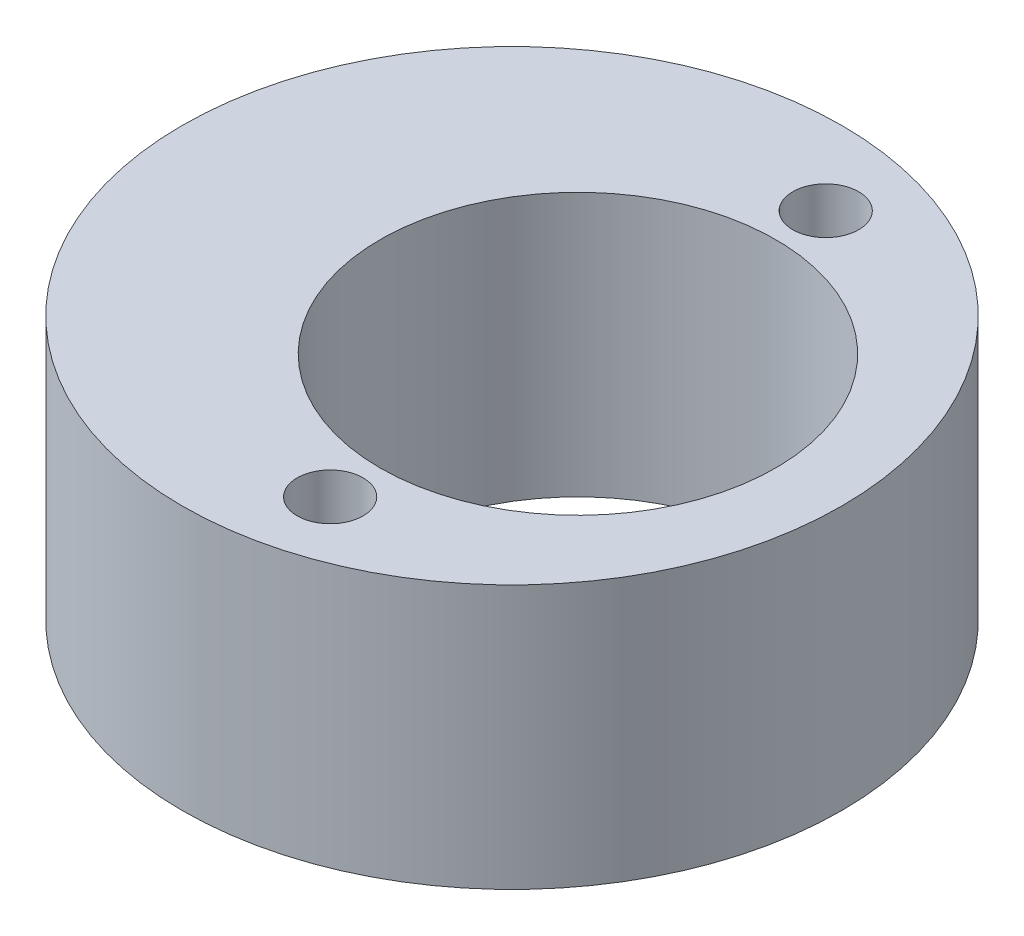
ISO-10303-21;
HEADER;
FILE_DESCRIPTION(('STEP AP214'),'2;1');
FILE_NAME('part.step','',(''),(''),'','','');
FILE_SCHEMA(('AUTOMOTIVE_DESIGN { 1 0 10303 214 1 1 1 1 }'));
ENDSEC;
DATA;
#1=APPLICATION_CONTEXT('core data for automotive mechanical design processes');
#2=APPLICATION_PROTOCOL_DEFINITION('international standard','automotive_design',2000,#1);
#3=PRODUCT_CONTEXT('',#1,'mechanical');
#4=PRODUCT('Part','Part','',(#3));
#5=PRODUCT_RELATED_PRODUCT_CATEGORY('part','',(#4));
#6=PRODUCT_DEFINITION_FORMATION('','',#4);
#7=PRODUCT_DEFINITION_CONTEXT('part definition',#1,'design');
#8=PRODUCT_DEFINITION('design','',#6,#7);
#9=PRODUCT_DEFINITION_SHAPE('','',#8);
#10=(LENGTH_UNIT() NAMED_UNIT(*) SI_UNIT(.MILLI.,.METRE.));
#11=(NAMED_UNIT(*) PLANE_ANGLE_UNIT() SI_UNIT($,.RADIAN.));
#12=(NAMED_UNIT(*) SI_UNIT($,.STERADIAN.) SOLID_ANGLE_UNIT());
#13=UNCERTAINTY_MEASURE_WITH_UNIT(LENGTH_MEASURE(1.E-05),#10,'distance_accuracy_value','');
#14=(GEOMETRIC_REPRESENTATION_CONTEXT(3) GLOBAL_UNCERTAINTY_ASSIGNED_CONTEXT((#13)) GLOBAL_UNIT_ASSIGNED_CONTEXT((#10,
#11,#12)) REPRESENTATION_CONTEXT('',''));
#15=CARTESIAN_POINT('',(0.,0.,0.));
#16=DIRECTION('',(0.,0.,1.));
#17=DIRECTION('',(1.,0.,0.));
#18=AXIS2_PLACEMENT_3D('',#15,#16,#17);
#19=CARTESIAN_POINT('',(-1.,4.,0.));
#20=DIRECTION('',(0.,1.,0.));
#21=DIRECTION('',(0.,0.,1.));
#22=AXIS2_PLACEMENT_3D('',#19,#20,#21);
#23=PLANE('',#22);
#24=CARTESIAN_POINT('',(0.,4.,-3.75791374723122));
#25=DIRECTION('',(0.,1.,0.));
#26=DIRECTION('',(0.,0.,1.));
#27=AXIS2_PLACEMENT_3D('',#24,#25,#26);
#28=CIRCLE('',#27,0.5);
#29=CARTESIAN_POINT('',(0.,4.,-3.25791374723122));
#30=VERTEX_POINT('',#29);
#31=EDGE_CURVE('E56',#30,#30,#28,.T.);
#32=ORIENTED_EDGE('',*,*,#31,.F.);
#33=EDGE_LOOP('',(#32));
#34=FACE_BOUND('',#33,.T.);
#35=CARTESIAN_POINT('',(0.,4.,3.75791374723122));
#36=DIRECTION('',(0.,1.,0.));
#37=DIRECTION('',(0.,0.,1.));
#38=AXIS2_PLACEMENT_3D('',#35,#36,#37);
#39=CIRCLE('',#38,0.5);
#40=CARTESIAN_POINT('',(0.,4.,4.25791374723122));
#41=VERTEX_POINT('',#40);
#42=EDGE_CURVE('E50',#41,#41,#39,.T.);
#43=ORIENTED_EDGE('',*,*,#42,.F.);
#44=EDGE_LOOP('',(#43));
#45=FACE_BOUND('',#44,.T.);
#46=CARTESIAN_POINT('',(-1.,4.,0.));
#47=DIRECTION('',(0.,1.,0.));
#48=DIRECTION('',(0.,0.,1.));
#49=AXIS2_PLACEMENT_3D('',#46,#47,#48);
#50=CIRCLE('',#49,5.);
#51=CARTESIAN_POINT('',(-1.,4.,5.));
#52=VERTEX_POINT('',#51);
#53=EDGE_CURVE('E10',#52,#52,#50,.T.);
#54=ORIENTED_EDGE('',*,*,#53,.T.);
#55=EDGE_LOOP('',(#54));
#56=FACE_BOUND('',#55,.T.);
#57=CARTESIAN_POINT('',(0.,4.,0.));
#58=DIRECTION('',(0.,1.,0.));
#59=DIRECTION('',(0.,0.,1.));
#60=AXIS2_PLACEMENT_3D('',#57,#58,#59);
#61=CIRCLE('',#60,3.);
#62=CARTESIAN_POINT('',(0.,4.,3.));
#63=VERTEX_POINT('',#62);
#64=EDGE_CURVE('E42',#63,#63,#61,.T.);
#65=ORIENTED_EDGE('',*,*,#64,.F.);
#66=EDGE_LOOP('',(#65));
#67=FACE_BOUND('',#66,.T.);
#68=ADVANCED_FACE('F31',(#34,#45,#56,#67),#23,.T.);
#69=CARTESIAN_POINT('',(-1.,0.,0.));
#70=DIRECTION('',(0.,1.,0.));
#71=DIRECTION('',(0.,0.,1.));
#72=AXIS2_PLACEMENT_3D('',#69,#70,#71);
#73=PLANE('',#72);
#74=CARTESIAN_POINT('',(0.,0.,-3.75791374723122));
#75=DIRECTION('',(0.,1.,0.));
#76=DIRECTION('',(0.,0.,1.));
#77=AXIS2_PLACEMENT_3D('',#74,#75,#76);
#78=CIRCLE('',#77,0.5);
#79=CARTESIAN_POINT('',(0.,0.,-3.25791374723122));
#80=VERTEX_POINT('',#79);
#81=EDGE_CURVE('E47',#80,#80,#78,.T.);
#82=ORIENTED_EDGE('',*,*,#81,.T.);
#83=EDGE_LOOP('',(#82));
#84=FACE_BOUND('',#83,.T.);
#85=CARTESIAN_POINT('',(0.,0.,3.75791374723122));
#86=DIRECTION('',(0.,1.,0.));
#87=DIRECTION('',(0.,0.,1.));
#88=AXIS2_PLACEMENT_3D('',#85,#86,#87);
#89=CIRCLE('',#88,0.5);
#90=CARTESIAN_POINT('',(0.,0.,4.25791374723122));
#91=VERTEX_POINT('',#90);
#92=EDGE_CURVE('E53',#91,#91,#89,.T.);
#93=ORIENTED_EDGE('',*,*,#92,.T.);
#94=EDGE_LOOP('',(#93));
#95=FACE_BOUND('',#94,.T.);
#96=CARTESIAN_POINT('',(-1.,0.,0.));
#97=DIRECTION('',(0.,1.,0.));
#98=DIRECTION('',(0.,0.,1.));
#99=AXIS2_PLACEMENT_3D('',#96,#97,#98);
#100=CIRCLE('',#99,5.);
#101=CARTESIAN_POINT('',(-1.,0.,5.));
#102=VERTEX_POINT('',#101);
#103=EDGE_CURVE('E35',#102,#102,#100,.T.);
#104=ORIENTED_EDGE('',*,*,#103,.F.);
#105=EDGE_LOOP('',(#104));
#106=FACE_BOUND('',#105,.T.);
#107=CARTESIAN_POINT('',(0.,0.,0.));
#108=DIRECTION('',(0.,1.,0.));
#109=DIRECTION('',(0.,0.,1.));
#110=AXIS2_PLACEMENT_3D('',#107,#108,#109);
#111=CIRCLE('',#110,3.);
#112=CARTESIAN_POINT('',(0.,0.,3.));
#113=VERTEX_POINT('',#112);
#114=EDGE_CURVE('E44',#113,#113,#111,.T.);
#115=ORIENTED_EDGE('',*,*,#114,.T.);
#116=EDGE_LOOP('',(#115));
#117=FACE_BOUND('',#116,.T.);
#118=ADVANCED_FACE('F62',(#84,#95,#106,#117),#73,.F.);
#119=CARTESIAN_POINT('',(-1.,4.,0.));
#120=DIRECTION('',(0.,-1.,0.));
#121=DIRECTION('',(0.,0.,-1.));
#122=AXIS2_PLACEMENT_3D('',#119,#120,#121);
#123=CYLINDRICAL_SURFACE('',#122,5.);
#124=ORIENTED_EDGE('',*,*,#53,.F.);
#125=EDGE_LOOP('',(#124));
#126=FACE_BOUND('',#125,.T.);
#127=ORIENTED_EDGE('',*,*,#103,.T.);
#128=EDGE_LOOP('',(#127));
#129=FACE_BOUND('',#128,.T.);
#130=ADVANCED_FACE('F33',(#126,#129),#123,.T.);
#131=CARTESIAN_POINT('',(0.,4.,0.));
#132=DIRECTION('',(0.,-1.,0.));
#133=DIRECTION('',(0.,0.,-1.));
#134=AXIS2_PLACEMENT_3D('',#131,#132,#133);
#135=CYLINDRICAL_SURFACE('',#134,3.);
#136=ORIENTED_EDGE('',*,*,#64,.T.);
#137=EDGE_LOOP('',(#136));
#138=FACE_BOUND('',#137,.T.);
#139=ORIENTED_EDGE('',*,*,#114,.F.);
#140=EDGE_LOOP('',(#139));
#141=FACE_BOUND('',#140,.T.);
#142=ADVANCED_FACE('F79',(#138,#141),#135,.F.);
#143=CARTESIAN_POINT('',(0.,0.,3.75791374723122));
#144=DIRECTION('',(0.,1.,0.));
#145=DIRECTION('',(0.,0.,1.));
#146=AXIS2_PLACEMENT_3D('',#143,#144,#145);
#147=CYLINDRICAL_SURFACE('',#146,0.5);
#148=ORIENTED_EDGE('',*,*,#92,.F.);
#149=EDGE_LOOP('',(#148));
#150=FACE_BOUND('',#149,.T.);
#151=ORIENTED_EDGE('',*,*,#42,.T.);
#152=EDGE_LOOP('',(#151));
#153=FACE_BOUND('',#152,.T.);
#154=ADVANCED_FACE('F68',(#150,#153),#147,.F.);
#155=CARTESIAN_POINT('',(0.,0.,-3.75791374723122));
#156=DIRECTION('',(0.,1.,0.));
#157=DIRECTION('',(0.,0.,1.));
#158=AXIS2_PLACEMENT_3D('',#155,#156,#157);
#159=CYLINDRICAL_SURFACE('',#158,0.5);
#160=ORIENTED_EDGE('',*,*,#81,.F.);
#161=EDGE_LOOP('',(#160));
#162=FACE_BOUND('',#161,.T.);
#163=ORIENTED_EDGE('',*,*,#31,.T.);
#164=EDGE_LOOP('',(#163));
#165=FACE_BOUND('',#164,.T.);
#166=ADVANCED_FACE('F65',(#162,#165),#159,.F.);
#167=CLOSED_SHELL('',(#68,#118,#130,#142,#154,#166));
#168=MANIFOLD_SOLID_BREP('B2',#167);
#169=ADVANCED_BREP_SHAPE_REPRESENTATION('',(#18,#168),#14);
#170=SHAPE_DEFINITION_REPRESENTATION(#9,#169);
ENDSEC;
END-ISO-10303-21;
